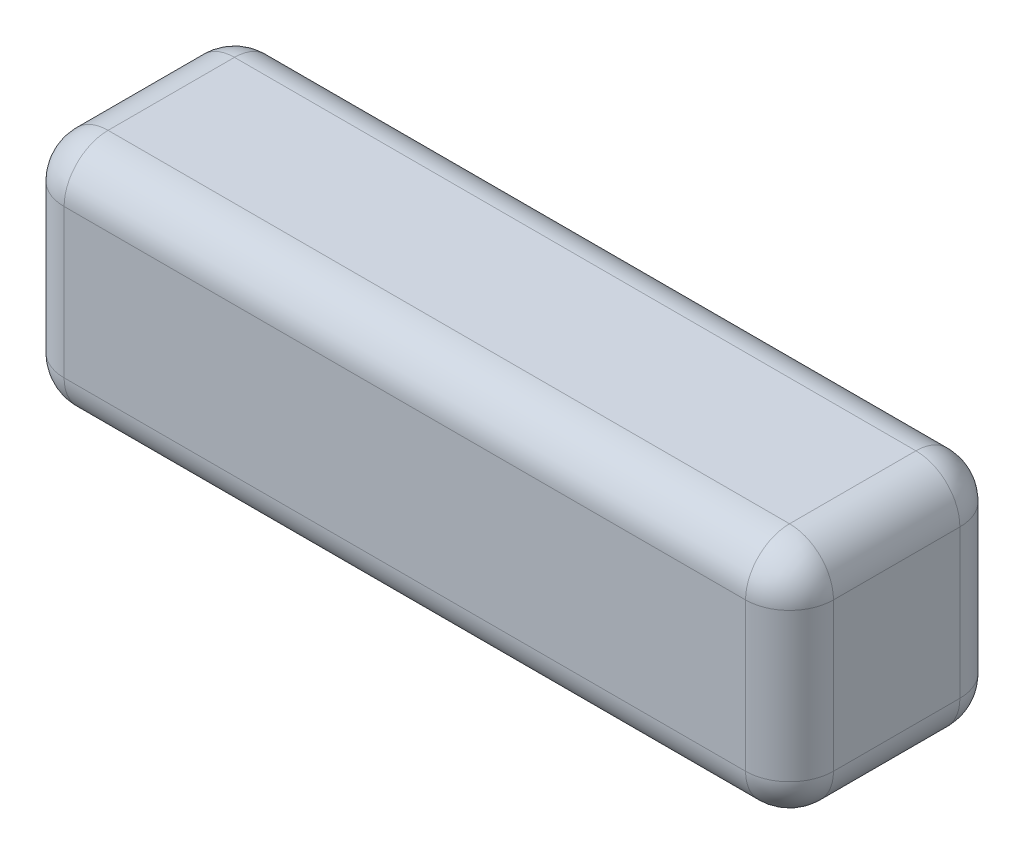
ISO-10303-21;
HEADER;
FILE_DESCRIPTION(('STEP AP214'),'2;1');
FILE_NAME('part.step','',(''),(''),'','','');
FILE_SCHEMA(('AUTOMOTIVE_DESIGN { 1 0 10303 214 1 1 1 1 }'));
ENDSEC;
DATA;
#1=APPLICATION_CONTEXT('core data for automotive mechanical design processes');
#2=APPLICATION_PROTOCOL_DEFINITION('international standard','automotive_design',2000,#1);
#3=PRODUCT_CONTEXT('',#1,'mechanical');
#4=PRODUCT('Part','Part','',(#3));
#5=PRODUCT_RELATED_PRODUCT_CATEGORY('part','',(#4));
#6=PRODUCT_DEFINITION_FORMATION('','',#4);
#7=PRODUCT_DEFINITION_CONTEXT('part definition',#1,'design');
#8=PRODUCT_DEFINITION('design','',#6,#7);
#9=PRODUCT_DEFINITION_SHAPE('','',#8);
#10=(LENGTH_UNIT() NAMED_UNIT(*) SI_UNIT(.MILLI.,.METRE.));
#11=(NAMED_UNIT(*) PLANE_ANGLE_UNIT() SI_UNIT($,.RADIAN.));
#12=(NAMED_UNIT(*) SI_UNIT($,.STERADIAN.) SOLID_ANGLE_UNIT());
#13=UNCERTAINTY_MEASURE_WITH_UNIT(LENGTH_MEASURE(1.E-05),#10,'distance_accuracy_value','');
#14=(GEOMETRIC_REPRESENTATION_CONTEXT(3) GLOBAL_UNCERTAINTY_ASSIGNED_CONTEXT((#13)) GLOBAL_UNIT_ASSIGNED_CONTEXT((#10,
#11,#12)) REPRESENTATION_CONTEXT('',''));
#15=CARTESIAN_POINT('',(0.,0.,0.));
#16=DIRECTION('',(0.,0.,1.));
#17=DIRECTION('',(1.,0.,0.));
#18=AXIS2_PLACEMENT_3D('',#15,#16,#17);
#19=CARTESIAN_POINT('',(0.,43.,0.));
#20=DIRECTION('',(1.,0.,0.));
#21=DIRECTION('',(0.,0.,-1.));
#22=AXIS2_PLACEMENT_3D('',#19,#20,#21);
#23=PLANE('',#22);
#24=DIRECTION('',(0.,-1.,0.));
#25=VECTOR('',#24,1.);
#26=CARTESIAN_POINT('',(0.,43.,31.));
#27=LINE('',#26,#25);
#28=CARTESIAN_POINT('',(0.,8.,31.));
#29=VERTEX_POINT('',#28);
#30=CARTESIAN_POINT('',(0.,35.,31.));
#31=VERTEX_POINT('',#30);
#32=EDGE_CURVE('E136',#29,#31,#27,.F.);
#33=ORIENTED_EDGE('',*,*,#32,.T.);
#34=DIRECTION('',(0.,0.,1.));
#35=VECTOR('',#34,1.);
#36=CARTESIAN_POINT('',(0.,35.,0.));
#37=LINE('',#36,#35);
#38=CARTESIAN_POINT('',(0.,35.,8.));
#39=VERTEX_POINT('',#38);
#40=EDGE_CURVE('E173',#31,#39,#37,.F.);
#41=ORIENTED_EDGE('',*,*,#40,.T.);
#42=DIRECTION('',(0.,-1.,0.));
#43=VECTOR('',#42,1.);
#44=CARTESIAN_POINT('',(0.,43.,8.));
#45=LINE('',#44,#43);
#46=CARTESIAN_POINT('',(0.,8.,8.));
#47=VERTEX_POINT('',#46);
#48=EDGE_CURVE('E170',#39,#47,#45,.T.);
#49=ORIENTED_EDGE('',*,*,#48,.T.);
#50=DIRECTION('',(0.,0.,1.));
#51=VECTOR('',#50,1.);
#52=CARTESIAN_POINT('',(0.,8.,0.));
#53=LINE('',#52,#51);
#54=EDGE_CURVE('E165',#47,#29,#53,.T.);
#55=ORIENTED_EDGE('',*,*,#54,.T.);
#56=EDGE_LOOP('',(#33,#41,#49,#55));
#57=FACE_BOUND('',#56,.T.);
#58=ADVANCED_FACE('F41',(#57),#23,.F.);
#59=CARTESIAN_POINT('',(0.,43.,39.));
#60=DIRECTION('',(0.,0.,-1.));
#61=DIRECTION('',(-1.,0.,0.));
#62=AXIS2_PLACEMENT_3D('',#59,#60,#61);
#63=PLANE('',#62);
#64=DIRECTION('',(0.,-1.,0.));
#65=VECTOR('',#64,1.);
#66=CARTESIAN_POINT('',(132.,43.,39.));
#67=LINE('',#66,#65);
#68=CARTESIAN_POINT('',(132.,8.,39.));
#69=VERTEX_POINT('',#68);
#70=CARTESIAN_POINT('',(132.,35.,39.));
#71=VERTEX_POINT('',#70);
#72=EDGE_CURVE('E158',#69,#71,#67,.F.);
#73=ORIENTED_EDGE('',*,*,#72,.T.);
#74=DIRECTION('',(1.,0.,0.));
#75=VECTOR('',#74,1.);
#76=CARTESIAN_POINT('',(0.,35.,39.));
#77=LINE('',#76,#75);
#78=CARTESIAN_POINT('',(8.,35.,39.));
#79=VERTEX_POINT('',#78);
#80=EDGE_CURVE('E162',#71,#79,#77,.F.);
#81=ORIENTED_EDGE('',*,*,#80,.T.);
#82=DIRECTION('',(0.,-1.,0.));
#83=VECTOR('',#82,1.);
#84=CARTESIAN_POINT('',(8.,43.,39.));
#85=LINE('',#84,#83);
#86=CARTESIAN_POINT('',(8.,8.,39.));
#87=VERTEX_POINT('',#86);
#88=EDGE_CURVE('E134',#79,#87,#85,.T.);
#89=ORIENTED_EDGE('',*,*,#88,.T.);
#90=DIRECTION('',(1.,0.,0.));
#91=VECTOR('',#90,1.);
#92=CARTESIAN_POINT('',(0.,8.,39.));
#93=LINE('',#92,#91);
#94=EDGE_CURVE('E152',#87,#69,#93,.T.);
#95=ORIENTED_EDGE('',*,*,#94,.T.);
#96=EDGE_LOOP('',(#73,#81,#89,#95));
#97=FACE_BOUND('',#96,.T.);
#98=ADVANCED_FACE('F160',(#97),#63,.F.);
#99=CARTESIAN_POINT('',(140.,43.,0.));
#100=DIRECTION('',(-1.,0.,0.));
#101=DIRECTION('',(0.,0.,1.));
#102=AXIS2_PLACEMENT_3D('',#99,#100,#101);
#103=PLANE('',#102);
#104=DIRECTION('',(0.,-1.,0.));
#105=VECTOR('',#104,1.);
#106=CARTESIAN_POINT('',(140.,43.,8.));
#107=LINE('',#106,#105);
#108=CARTESIAN_POINT('',(140.,8.,8.));
#109=VERTEX_POINT('',#108);
#110=CARTESIAN_POINT('',(140.,35.,8.));
#111=VERTEX_POINT('',#110);
#112=EDGE_CURVE('E177',#109,#111,#107,.F.);
#113=ORIENTED_EDGE('',*,*,#112,.T.);
#114=DIRECTION('',(0.,0.,-1.));
#115=VECTOR('',#114,1.);
#116=CARTESIAN_POINT('',(140.,35.,39.));
#117=LINE('',#116,#115);
#118=CARTESIAN_POINT('',(140.,35.,31.));
#119=VERTEX_POINT('',#118);
#120=EDGE_CURVE('E182',#111,#119,#117,.F.);
#121=ORIENTED_EDGE('',*,*,#120,.T.);
#122=DIRECTION('',(0.,-1.,0.));
#123=VECTOR('',#122,1.);
#124=CARTESIAN_POINT('',(140.,43.,31.));
#125=LINE('',#124,#123);
#126=CARTESIAN_POINT('',(140.,8.,31.));
#127=VERTEX_POINT('',#126);
#128=EDGE_CURVE('E179',#119,#127,#125,.T.);
#129=ORIENTED_EDGE('',*,*,#128,.T.);
#130=DIRECTION('',(0.,0.,-1.));
#131=VECTOR('',#130,1.);
#132=CARTESIAN_POINT('',(140.,8.,0.));
#133=LINE('',#132,#131);
#134=EDGE_CURVE('E175',#127,#109,#133,.T.);
#135=ORIENTED_EDGE('',*,*,#134,.T.);
#136=EDGE_LOOP('',(#113,#121,#129,#135));
#137=FACE_BOUND('',#136,.T.);
#138=ADVANCED_FACE('F287',(#137),#103,.F.);
#139=CARTESIAN_POINT('',(0.,43.,0.));
#140=DIRECTION('',(0.,0.,1.));
#141=DIRECTION('',(1.,0.,0.));
#142=AXIS2_PLACEMENT_3D('',#139,#140,#141);
#143=PLANE('',#142);
#144=DIRECTION('',(0.,-1.,0.));
#145=VECTOR('',#144,1.);
#146=CARTESIAN_POINT('',(8.,43.,0.));
#147=LINE('',#146,#145);
#148=CARTESIAN_POINT('',(8.,8.,0.));
#149=VERTEX_POINT('',#148);
#150=CARTESIAN_POINT('',(8.,35.,0.));
#151=VERTEX_POINT('',#150);
#152=EDGE_CURVE('E186',#149,#151,#147,.F.);
#153=ORIENTED_EDGE('',*,*,#152,.T.);
#154=DIRECTION('',(-1.,0.,0.));
#155=VECTOR('',#154,1.);
#156=CARTESIAN_POINT('',(140.,35.,0.));
#157=LINE('',#156,#155);
#158=CARTESIAN_POINT('',(132.,35.,0.));
#159=VERTEX_POINT('',#158);
#160=EDGE_CURVE('E191',#151,#159,#157,.F.);
#161=ORIENTED_EDGE('',*,*,#160,.T.);
#162=DIRECTION('',(0.,-1.,0.));
#163=VECTOR('',#162,1.);
#164=CARTESIAN_POINT('',(132.,43.,0.));
#165=LINE('',#164,#163);
#166=CARTESIAN_POINT('',(132.,8.,0.));
#167=VERTEX_POINT('',#166);
#168=EDGE_CURVE('E188',#159,#167,#165,.T.);
#169=ORIENTED_EDGE('',*,*,#168,.T.);
#170=DIRECTION('',(-1.,0.,0.));
#171=VECTOR('',#170,1.);
#172=CARTESIAN_POINT('',(0.,8.,0.));
#173=LINE('',#172,#171);
#174=EDGE_CURVE('E184',#167,#149,#173,.T.);
#175=ORIENTED_EDGE('',*,*,#174,.T.);
#176=EDGE_LOOP('',(#153,#161,#169,#175));
#177=FACE_BOUND('',#176,.T.);
#178=ADVANCED_FACE('F297',(#177),#143,.F.);
#179=CARTESIAN_POINT('',(0.,43.,0.));
#180=DIRECTION('',(0.,1.,0.));
#181=DIRECTION('',(0.,0.,1.));
#182=AXIS2_PLACEMENT_3D('',#179,#180,#181);
#183=PLANE('',#182);
#184=DIRECTION('',(0.,0.,-1.));
#185=VECTOR('',#184,1.);
#186=CARTESIAN_POINT('',(132.,43.,0.));
#187=LINE('',#186,#185);
#188=CARTESIAN_POINT('',(132.,43.,31.));
#189=VERTEX_POINT('',#188);
#190=CARTESIAN_POINT('',(132.,43.,8.));
#191=VERTEX_POINT('',#190);
#192=EDGE_CURVE('E197',#189,#191,#187,.T.);
#193=ORIENTED_EDGE('',*,*,#192,.T.);
#194=DIRECTION('',(-1.,0.,0.));
#195=VECTOR('',#194,1.);
#196=CARTESIAN_POINT('',(0.,43.,8.));
#197=LINE('',#196,#195);
#198=CARTESIAN_POINT('',(8.,43.,8.));
#199=VERTEX_POINT('',#198);
#200=EDGE_CURVE('E199',#191,#199,#197,.T.);
#201=ORIENTED_EDGE('',*,*,#200,.T.);
#202=DIRECTION('',(0.,0.,1.));
#203=VECTOR('',#202,1.);
#204=CARTESIAN_POINT('',(8.,43.,39.));
#205=LINE('',#204,#203);
#206=CARTESIAN_POINT('',(8.,43.,31.));
#207=VERTEX_POINT('',#206);
#208=EDGE_CURVE('E193',#199,#207,#205,.T.);
#209=ORIENTED_EDGE('',*,*,#208,.T.);
#210=DIRECTION('',(1.,0.,0.));
#211=VECTOR('',#210,1.);
#212=CARTESIAN_POINT('',(140.,43.,31.));
#213=LINE('',#212,#211);
#214=EDGE_CURVE('E195',#207,#189,#213,.T.);
#215=ORIENTED_EDGE('',*,*,#214,.T.);
#216=EDGE_LOOP('',(#193,#201,#209,#215));
#217=FACE_BOUND('',#216,.T.);
#218=ADVANCED_FACE('F279',(#217),#183,.T.);
#219=CARTESIAN_POINT('',(0.,0.,0.));
#220=DIRECTION('',(0.,1.,0.));
#221=DIRECTION('',(0.,0.,1.));
#222=AXIS2_PLACEMENT_3D('',#219,#220,#221);
#223=PLANE('',#222);
#224=DIRECTION('',(0.,0.,1.));
#225=VECTOR('',#224,1.);
#226=CARTESIAN_POINT('',(8.,0.,0.));
#227=LINE('',#226,#225);
#228=CARTESIAN_POINT('',(8.,0.,31.));
#229=VERTEX_POINT('',#228);
#230=CARTESIAN_POINT('',(8.,0.,8.));
#231=VERTEX_POINT('',#230);
#232=EDGE_CURVE('E202',#229,#231,#227,.F.);
#233=ORIENTED_EDGE('',*,*,#232,.T.);
#234=DIRECTION('',(-1.,0.,0.));
#235=VECTOR('',#234,1.);
#236=CARTESIAN_POINT('',(0.,0.,8.));
#237=LINE('',#236,#235);
#238=CARTESIAN_POINT('',(132.,0.,8.));
#239=VERTEX_POINT('',#238);
#240=EDGE_CURVE('E11',#231,#239,#237,.F.);
#241=ORIENTED_EDGE('',*,*,#240,.T.);
#242=DIRECTION('',(0.,0.,-1.));
#243=VECTOR('',#242,1.);
#244=CARTESIAN_POINT('',(132.,0.,0.));
#245=LINE('',#244,#243);
#246=CARTESIAN_POINT('',(132.,0.,31.));
#247=VERTEX_POINT('',#246);
#248=EDGE_CURVE('E50',#239,#247,#245,.F.);
#249=ORIENTED_EDGE('',*,*,#248,.T.);
#250=DIRECTION('',(1.,0.,0.));
#251=VECTOR('',#250,1.);
#252=CARTESIAN_POINT('',(0.,0.,31.));
#253=LINE('',#252,#251);
#254=EDGE_CURVE('E204',#247,#229,#253,.F.);
#255=ORIENTED_EDGE('',*,*,#254,.T.);
#256=EDGE_LOOP('',(#233,#241,#249,#255));
#257=FACE_BOUND('',#256,.T.);
#258=ADVANCED_FACE('F525',(#257),#223,.F.);
#259=CARTESIAN_POINT('',(132.,43.,8.));
#260=DIRECTION('',(0.,-1.,0.));
#261=DIRECTION('',(0.,0.,-1.));
#262=AXIS2_PLACEMENT_3D('',#259,#260,#261);
#263=CYLINDRICAL_SURFACE('',#262,8.);
#264=CARTESIAN_POINT('',(132.,35.,8.));
#265=DIRECTION('',(0.,1.,0.));
#266=DIRECTION('',(0.,0.,1.));
#267=AXIS2_PLACEMENT_3D('',#264,#265,#266);
#268=CIRCLE('',#267,8.);
#269=EDGE_CURVE('E45',#111,#159,#268,.T.);
#270=ORIENTED_EDGE('',*,*,#269,.F.);
#271=ORIENTED_EDGE('',*,*,#112,.F.);
#272=CARTESIAN_POINT('',(132.,8.,8.));
#273=DIRECTION('',(0.,-1.,0.));
#274=DIRECTION('',(0.,0.,-1.));
#275=AXIS2_PLACEMENT_3D('',#272,#273,#274);
#276=CIRCLE('',#275,8.);
#277=EDGE_CURVE('E257',#167,#109,#276,.T.);
#278=ORIENTED_EDGE('',*,*,#277,.F.);
#279=ORIENTED_EDGE('',*,*,#168,.F.);
#280=EDGE_LOOP('',(#270,#271,#278,#279));
#281=FACE_BOUND('',#280,.T.);
#282=ADVANCED_FACE('F43',(#281),#263,.T.);
#283=CARTESIAN_POINT('',(132.,35.,8.));
#284=DIRECTION('',(0.,0.,-1.));
#285=DIRECTION('',(-1.,0.,0.));
#286=AXIS2_PLACEMENT_3D('',#283,#284,#285);
#287=SPHERICAL_SURFACE('',#286,8.);
#288=CARTESIAN_POINT('',(132.,35.,8.));
#289=DIRECTION('',(0.,0.,-1.));
#290=DIRECTION('',(-1.,0.,0.));
#291=AXIS2_PLACEMENT_3D('',#288,#289,#290);
#292=CIRCLE('',#291,8.);
#293=EDGE_CURVE('E252',#111,#191,#292,.F.);
#294=ORIENTED_EDGE('',*,*,#293,.F.);
#295=ORIENTED_EDGE('',*,*,#269,.T.);
#296=CARTESIAN_POINT('',(132.,35.,8.));
#297=DIRECTION('',(1.,0.,0.));
#298=DIRECTION('',(0.,0.,-1.));
#299=AXIS2_PLACEMENT_3D('',#296,#297,#298);
#300=CIRCLE('',#299,8.);
#301=EDGE_CURVE('E255',#191,#159,#300,.F.);
#302=ORIENTED_EDGE('',*,*,#301,.F.);
#303=EDGE_LOOP('',(#294,#295,#302));
#304=FACE_BOUND('',#303,.T.);
#305=ADVANCED_FACE('F267',(#304),#287,.T.);
#306=CARTESIAN_POINT('',(132.,8.,8.));
#307=DIRECTION('',(1.,0.,0.));
#308=DIRECTION('',(0.,0.,-1.));
#309=AXIS2_PLACEMENT_3D('',#306,#307,#308);
#310=SPHERICAL_SURFACE('',#309,8.);
#311=CARTESIAN_POINT('',(132.,8.,8.));
#312=DIRECTION('',(1.,0.,0.));
#313=DIRECTION('',(0.,0.,-1.));
#314=AXIS2_PLACEMENT_3D('',#311,#312,#313);
#315=CIRCLE('',#314,8.);
#316=EDGE_CURVE('E247',#167,#239,#315,.F.);
#317=ORIENTED_EDGE('',*,*,#316,.F.);
#318=ORIENTED_EDGE('',*,*,#277,.T.);
#319=CARTESIAN_POINT('',(132.,8.,8.));
#320=DIRECTION('',(0.,0.,-1.));
#321=DIRECTION('',(-1.,0.,0.));
#322=AXIS2_PLACEMENT_3D('',#319,#320,#321);
#323=CIRCLE('',#322,8.);
#324=EDGE_CURVE('E250',#239,#109,#323,.F.);
#325=ORIENTED_EDGE('',*,*,#324,.F.);
#326=EDGE_LOOP('',(#317,#318,#325));
#327=FACE_BOUND('',#326,.T.);
#328=ADVANCED_FACE('F498',(#327),#310,.T.);
#329=CARTESIAN_POINT('',(0.,35.,8.));
#330=DIRECTION('',(1.,0.,0.));
#331=DIRECTION('',(0.,0.,-1.));
#332=AXIS2_PLACEMENT_3D('',#329,#330,#331);
#333=CYLINDRICAL_SURFACE('',#332,8.);
#334=ORIENTED_EDGE('',*,*,#301,.T.);
#335=ORIENTED_EDGE('',*,*,#160,.F.);
#336=CARTESIAN_POINT('',(8.,35.,8.));
#337=DIRECTION('',(-1.,0.,0.));
#338=DIRECTION('',(0.,0.,1.));
#339=AXIS2_PLACEMENT_3D('',#336,#337,#338);
#340=CIRCLE('',#339,8.);
#341=EDGE_CURVE('E241',#199,#151,#340,.T.);
#342=ORIENTED_EDGE('',*,*,#341,.F.);
#343=ORIENTED_EDGE('',*,*,#200,.F.);
#344=EDGE_LOOP('',(#334,#335,#342,#343));
#345=FACE_BOUND('',#344,.T.);
#346=ADVANCED_FACE('F275',(#345),#333,.T.);
#347=CARTESIAN_POINT('',(132.,35.,0.));
#348=DIRECTION('',(0.,0.,1.));
#349=DIRECTION('',(1.,0.,0.));
#350=AXIS2_PLACEMENT_3D('',#347,#348,#349);
#351=CYLINDRICAL_SURFACE('',#350,8.);
#352=ORIENTED_EDGE('',*,*,#293,.T.);
#353=ORIENTED_EDGE('',*,*,#192,.F.);
#354=CARTESIAN_POINT('',(132.,35.,31.));
#355=DIRECTION('',(0.,0.,1.));
#356=DIRECTION('',(1.,0.,0.));
#357=AXIS2_PLACEMENT_3D('',#354,#355,#356);
#358=CIRCLE('',#357,8.);
#359=EDGE_CURVE('E238',#119,#189,#358,.T.);
#360=ORIENTED_EDGE('',*,*,#359,.F.);
#361=ORIENTED_EDGE('',*,*,#120,.F.);
#362=EDGE_LOOP('',(#352,#353,#360,#361));
#363=FACE_BOUND('',#362,.T.);
#364=ADVANCED_FACE('F284',(#363),#351,.T.);
#365=CARTESIAN_POINT('',(132.,43.,31.));
#366=DIRECTION('',(0.,-1.,0.));
#367=DIRECTION('',(0.,0.,-1.));
#368=AXIS2_PLACEMENT_3D('',#365,#366,#367);
#369=CYLINDRICAL_SURFACE('',#368,8.);
#370=CARTESIAN_POINT('',(132.,8.,31.));
#371=DIRECTION('',(0.,-1.,0.));
#372=DIRECTION('',(0.,0.,-1.));
#373=AXIS2_PLACEMENT_3D('',#370,#371,#372);
#374=CIRCLE('',#373,8.);
#375=EDGE_CURVE('E232',#127,#69,#374,.T.);
#376=ORIENTED_EDGE('',*,*,#375,.F.);
#377=ORIENTED_EDGE('',*,*,#128,.F.);
#378=CARTESIAN_POINT('',(132.,35.,31.));
#379=DIRECTION('',(0.,1.,0.));
#380=DIRECTION('',(0.,0.,1.));
#381=AXIS2_PLACEMENT_3D('',#378,#379,#380);
#382=CIRCLE('',#381,8.);
#383=EDGE_CURVE('E235',#71,#119,#382,.T.);
#384=ORIENTED_EDGE('',*,*,#383,.F.);
#385=ORIENTED_EDGE('',*,*,#72,.F.);
#386=EDGE_LOOP('',(#376,#377,#384,#385));
#387=FACE_BOUND('',#386,.T.);
#388=ADVANCED_FACE('F291',(#387),#369,.T.);
#389=CARTESIAN_POINT('',(132.,8.,0.));
#390=DIRECTION('',(0.,0.,-1.));
#391=DIRECTION('',(-1.,0.,0.));
#392=AXIS2_PLACEMENT_3D('',#389,#390,#391);
#393=CYLINDRICAL_SURFACE('',#392,8.);
#394=ORIENTED_EDGE('',*,*,#324,.T.);
#395=ORIENTED_EDGE('',*,*,#134,.F.);
#396=CARTESIAN_POINT('',(132.,8.,31.));
#397=DIRECTION('',(0.,0.,1.));
#398=DIRECTION('',(1.,0.,0.));
#399=AXIS2_PLACEMENT_3D('',#396,#397,#398);
#400=CIRCLE('',#399,8.);
#401=EDGE_CURVE('E230',#247,#127,#400,.T.);
#402=ORIENTED_EDGE('',*,*,#401,.F.);
#403=ORIENTED_EDGE('',*,*,#248,.F.);
#404=EDGE_LOOP('',(#394,#395,#402,#403));
#405=FACE_BOUND('',#404,.T.);
#406=ADVANCED_FACE('F295',(#405),#393,.T.);
#407=CARTESIAN_POINT('',(0.,8.,8.));
#408=DIRECTION('',(-1.,0.,0.));
#409=DIRECTION('',(0.,0.,1.));
#410=AXIS2_PLACEMENT_3D('',#407,#408,#409);
#411=CYLINDRICAL_SURFACE('',#410,8.);
#412=ORIENTED_EDGE('',*,*,#316,.T.);
#413=ORIENTED_EDGE('',*,*,#240,.F.);
#414=CARTESIAN_POINT('',(8.,8.,8.));
#415=DIRECTION('',(-1.,0.,0.));
#416=DIRECTION('',(0.,0.,1.));
#417=AXIS2_PLACEMENT_3D('',#414,#415,#416);
#418=CIRCLE('',#417,8.);
#419=EDGE_CURVE('E227',#149,#231,#418,.T.);
#420=ORIENTED_EDGE('',*,*,#419,.F.);
#421=ORIENTED_EDGE('',*,*,#174,.F.);
#422=EDGE_LOOP('',(#412,#413,#420,#421));
#423=FACE_BOUND('',#422,.T.);
#424=ADVANCED_FACE('F307',(#423),#411,.T.);
#425=CARTESIAN_POINT('',(8.,43.,8.));
#426=DIRECTION('',(0.,-1.,0.));
#427=DIRECTION('',(0.,0.,-1.));
#428=AXIS2_PLACEMENT_3D('',#425,#426,#427);
#429=CYLINDRICAL_SURFACE('',#428,8.);
#430=CARTESIAN_POINT('',(8.,35.,8.));
#431=DIRECTION('',(0.,1.,0.));
#432=DIRECTION('',(0.,0.,1.));
#433=AXIS2_PLACEMENT_3D('',#430,#431,#432);
#434=CIRCLE('',#433,8.);
#435=EDGE_CURVE('E244',#151,#39,#434,.T.);
#436=ORIENTED_EDGE('',*,*,#435,.F.);
#437=ORIENTED_EDGE('',*,*,#152,.F.);
#438=CARTESIAN_POINT('',(8.,8.,8.));
#439=DIRECTION('',(0.,-1.,0.));
#440=DIRECTION('',(0.,0.,-1.));
#441=AXIS2_PLACEMENT_3D('',#438,#439,#440);
#442=CIRCLE('',#441,8.);
#443=EDGE_CURVE('E224',#47,#149,#442,.T.);
#444=ORIENTED_EDGE('',*,*,#443,.F.);
#445=ORIENTED_EDGE('',*,*,#48,.F.);
#446=EDGE_LOOP('',(#436,#437,#444,#445));
#447=FACE_BOUND('',#446,.T.);
#448=ADVANCED_FACE('F302',(#447),#429,.T.);
#449=CARTESIAN_POINT('',(8.,35.,8.));
#450=DIRECTION('',(0.,0.,-1.));
#451=DIRECTION('',(-1.,0.,0.));
#452=AXIS2_PLACEMENT_3D('',#449,#450,#451);
#453=SPHERICAL_SURFACE('',#452,8.);
#454=ORIENTED_EDGE('',*,*,#341,.T.);
#455=ORIENTED_EDGE('',*,*,#435,.T.);
#456=CARTESIAN_POINT('',(8.,35.,8.));
#457=DIRECTION('',(0.,0.,-1.));
#458=DIRECTION('',(-1.,0.,0.));
#459=AXIS2_PLACEMENT_3D('',#456,#457,#458);
#460=CIRCLE('',#459,8.);
#461=EDGE_CURVE('E221',#199,#39,#460,.F.);
#462=ORIENTED_EDGE('',*,*,#461,.F.);
#463=EDGE_LOOP('',(#454,#455,#462));
#464=FACE_BOUND('',#463,.T.);
#465=ADVANCED_FACE('F318',(#464),#453,.T.);
#466=CARTESIAN_POINT('',(132.,35.,31.));
#467=DIRECTION('',(1.,0.,0.));
#468=DIRECTION('',(0.,0.,-1.));
#469=AXIS2_PLACEMENT_3D('',#466,#467,#468);
#470=SPHERICAL_SURFACE('',#469,8.);
#471=ORIENTED_EDGE('',*,*,#383,.T.);
#472=ORIENTED_EDGE('',*,*,#359,.T.);
#473=CARTESIAN_POINT('',(132.,35.,31.));
#474=DIRECTION('',(1.,0.,0.));
#475=DIRECTION('',(0.,0.,-1.));
#476=AXIS2_PLACEMENT_3D('',#473,#474,#475);
#477=CIRCLE('',#476,8.);
#478=EDGE_CURVE('E218',#71,#189,#477,.F.);
#479=ORIENTED_EDGE('',*,*,#478,.F.);
#480=EDGE_LOOP('',(#471,#472,#479));
#481=FACE_BOUND('',#480,.T.);
#482=ADVANCED_FACE('F328',(#481),#470,.T.);
#483=CARTESIAN_POINT('',(132.,8.,31.));
#484=DIRECTION('',(1.,0.,0.));
#485=DIRECTION('',(0.,0.,-1.));
#486=AXIS2_PLACEMENT_3D('',#483,#484,#485);
#487=SPHERICAL_SURFACE('',#486,8.);
#488=ORIENTED_EDGE('',*,*,#401,.T.);
#489=ORIENTED_EDGE('',*,*,#375,.T.);
#490=CARTESIAN_POINT('',(132.,8.,31.));
#491=DIRECTION('',(1.,0.,0.));
#492=DIRECTION('',(0.,0.,-1.));
#493=AXIS2_PLACEMENT_3D('',#490,#491,#492);
#494=CIRCLE('',#493,8.);
#495=EDGE_CURVE('E155',#247,#69,#494,.F.);
#496=ORIENTED_EDGE('',*,*,#495,.F.);
#497=EDGE_LOOP('',(#488,#489,#496));
#498=FACE_BOUND('',#497,.T.);
#499=ADVANCED_FACE('F330',(#498),#487,.T.);
#500=CARTESIAN_POINT('',(8.,8.,8.));
#501=DIRECTION('',(0.,0.,-1.));
#502=DIRECTION('',(-1.,0.,0.));
#503=AXIS2_PLACEMENT_3D('',#500,#501,#502);
#504=SPHERICAL_SURFACE('',#503,8.);
#505=ORIENTED_EDGE('',*,*,#443,.T.);
#506=ORIENTED_EDGE('',*,*,#419,.T.);
#507=CARTESIAN_POINT('',(8.,8.,8.));
#508=DIRECTION('',(0.,0.,-1.));
#509=DIRECTION('',(-1.,0.,0.));
#510=AXIS2_PLACEMENT_3D('',#507,#508,#509);
#511=CIRCLE('',#510,8.);
#512=EDGE_CURVE('E214',#47,#231,#511,.F.);
#513=ORIENTED_EDGE('',*,*,#512,.F.);
#514=EDGE_LOOP('',(#505,#506,#513));
#515=FACE_BOUND('',#514,.T.);
#516=ADVANCED_FACE('F309',(#515),#504,.T.);
#517=CARTESIAN_POINT('',(8.,35.,0.));
#518=DIRECTION('',(0.,0.,-1.));
#519=DIRECTION('',(-1.,0.,0.));
#520=AXIS2_PLACEMENT_3D('',#517,#518,#519);
#521=CYLINDRICAL_SURFACE('',#520,8.);
#522=ORIENTED_EDGE('',*,*,#461,.T.);
#523=ORIENTED_EDGE('',*,*,#40,.F.);
#524=CARTESIAN_POINT('',(8.,35.,31.));
#525=DIRECTION('',(0.,0.,1.));
#526=DIRECTION('',(1.,0.,0.));
#527=AXIS2_PLACEMENT_3D('',#524,#525,#526);
#528=CIRCLE('',#527,8.);
#529=EDGE_CURVE('E211',#207,#31,#528,.T.);
#530=ORIENTED_EDGE('',*,*,#529,.F.);
#531=ORIENTED_EDGE('',*,*,#208,.F.);
#532=EDGE_LOOP('',(#522,#523,#530,#531));
#533=FACE_BOUND('',#532,.T.);
#534=ADVANCED_FACE('F320',(#533),#521,.T.);
#535=CARTESIAN_POINT('',(0.,35.,31.));
#536=DIRECTION('',(-1.,0.,0.));
#537=DIRECTION('',(0.,0.,1.));
#538=AXIS2_PLACEMENT_3D('',#535,#536,#537);
#539=CYLINDRICAL_SURFACE('',#538,8.);
#540=ORIENTED_EDGE('',*,*,#478,.T.);
#541=ORIENTED_EDGE('',*,*,#214,.F.);
#542=CARTESIAN_POINT('',(8.,35.,31.));
#543=DIRECTION('',(-1.,0.,0.));
#544=DIRECTION('',(0.,0.,1.));
#545=AXIS2_PLACEMENT_3D('',#542,#543,#544);
#546=CIRCLE('',#545,8.);
#547=EDGE_CURVE('E149',#79,#207,#546,.T.);
#548=ORIENTED_EDGE('',*,*,#547,.F.);
#549=ORIENTED_EDGE('',*,*,#80,.F.);
#550=EDGE_LOOP('',(#540,#541,#548,#549));
#551=FACE_BOUND('',#550,.T.);
#552=ADVANCED_FACE('F326',(#551),#539,.T.);
#553=CARTESIAN_POINT('',(0.,8.,31.));
#554=DIRECTION('',(1.,0.,0.));
#555=DIRECTION('',(0.,0.,-1.));
#556=AXIS2_PLACEMENT_3D('',#553,#554,#555);
#557=CYLINDRICAL_SURFACE('',#556,8.);
#558=ORIENTED_EDGE('',*,*,#495,.T.);
#559=ORIENTED_EDGE('',*,*,#94,.F.);
#560=CARTESIAN_POINT('',(8.,8.,31.));
#561=DIRECTION('',(-1.,0.,0.));
#562=DIRECTION('',(0.,0.,1.));
#563=AXIS2_PLACEMENT_3D('',#560,#561,#562);
#564=CIRCLE('',#563,8.);
#565=EDGE_CURVE('E142',#229,#87,#564,.T.);
#566=ORIENTED_EDGE('',*,*,#565,.F.);
#567=ORIENTED_EDGE('',*,*,#254,.F.);
#568=EDGE_LOOP('',(#558,#559,#566,#567));
#569=FACE_BOUND('',#568,.T.);
#570=ADVANCED_FACE('F153',(#569),#557,.T.);
#571=CARTESIAN_POINT('',(8.,8.,0.));
#572=DIRECTION('',(0.,0.,1.));
#573=DIRECTION('',(1.,0.,0.));
#574=AXIS2_PLACEMENT_3D('',#571,#572,#573);
#575=CYLINDRICAL_SURFACE('',#574,8.);
#576=ORIENTED_EDGE('',*,*,#512,.T.);
#577=ORIENTED_EDGE('',*,*,#232,.F.);
#578=CARTESIAN_POINT('',(8.,8.,31.));
#579=DIRECTION('',(0.,0.,1.));
#580=DIRECTION('',(1.,0.,0.));
#581=AXIS2_PLACEMENT_3D('',#578,#579,#580);
#582=CIRCLE('',#581,8.);
#583=EDGE_CURVE('E146',#29,#229,#582,.T.);
#584=ORIENTED_EDGE('',*,*,#583,.F.);
#585=ORIENTED_EDGE('',*,*,#54,.F.);
#586=EDGE_LOOP('',(#576,#577,#584,#585));
#587=FACE_BOUND('',#586,.T.);
#588=ADVANCED_FACE('F313',(#587),#575,.T.);
#589=CARTESIAN_POINT('',(8.,35.,31.));
#590=DIRECTION('',(0.,1.,0.));
#591=DIRECTION('',(0.,0.,1.));
#592=AXIS2_PLACEMENT_3D('',#589,#590,#591);
#593=SPHERICAL_SURFACE('',#592,8.);
#594=ORIENTED_EDGE('',*,*,#547,.T.);
#595=ORIENTED_EDGE('',*,*,#529,.T.);
#596=CARTESIAN_POINT('',(8.,35.,31.));
#597=DIRECTION('',(0.,1.,0.));
#598=DIRECTION('',(0.,0.,1.));
#599=AXIS2_PLACEMENT_3D('',#596,#597,#598);
#600=CIRCLE('',#599,8.);
#601=EDGE_CURVE('E139',#79,#31,#600,.F.);
#602=ORIENTED_EDGE('',*,*,#601,.F.);
#603=EDGE_LOOP('',(#594,#595,#602));
#604=FACE_BOUND('',#603,.T.);
#605=ADVANCED_FACE('F324',(#604),#593,.T.);
#606=CARTESIAN_POINT('',(8.,8.,31.));
#607=DIRECTION('',(0.,-1.,0.));
#608=DIRECTION('',(0.,0.,-1.));
#609=AXIS2_PLACEMENT_3D('',#606,#607,#608);
#610=SPHERICAL_SURFACE('',#609,8.);
#611=ORIENTED_EDGE('',*,*,#583,.T.);
#612=ORIENTED_EDGE('',*,*,#565,.T.);
#613=CARTESIAN_POINT('',(8.,8.,31.));
#614=DIRECTION('',(0.,-1.,0.));
#615=DIRECTION('',(0.,0.,-1.));
#616=AXIS2_PLACEMENT_3D('',#613,#614,#615);
#617=CIRCLE('',#616,8.);
#618=EDGE_CURVE('E130',#29,#87,#617,.F.);
#619=ORIENTED_EDGE('',*,*,#618,.F.);
#620=EDGE_LOOP('',(#611,#612,#619));
#621=FACE_BOUND('',#620,.T.);
#622=ADVANCED_FACE('F144',(#621),#610,.T.);
#623=CARTESIAN_POINT('',(8.,43.,31.));
#624=DIRECTION('',(0.,-1.,0.));
#625=DIRECTION('',(0.,0.,-1.));
#626=AXIS2_PLACEMENT_3D('',#623,#624,#625);
#627=CYLINDRICAL_SURFACE('',#626,8.);
#628=ORIENTED_EDGE('',*,*,#601,.T.);
#629=ORIENTED_EDGE('',*,*,#32,.F.);
#630=ORIENTED_EDGE('',*,*,#618,.T.);
#631=ORIENTED_EDGE('',*,*,#88,.F.);
#632=EDGE_LOOP('',(#628,#629,#630,#631));
#633=FACE_BOUND('',#632,.T.);
#634=ADVANCED_FACE('F132',(#633),#627,.T.);
#635=CLOSED_SHELL('',(#58,#98,#138,#178,#218,#258,#282,#305,#328,#346,#364,#388,#406,#424,#448,
#465,#482,#499,#516,#534,#552,#570,#588,#605,#622,#634));
#636=MANIFOLD_SOLID_BREP('B2',#635);
#637=ADVANCED_BREP_SHAPE_REPRESENTATION('',(#18,#636),#14);
#638=SHAPE_DEFINITION_REPRESENTATION(#9,#637);
ENDSEC;
END-ISO-10303-21;
